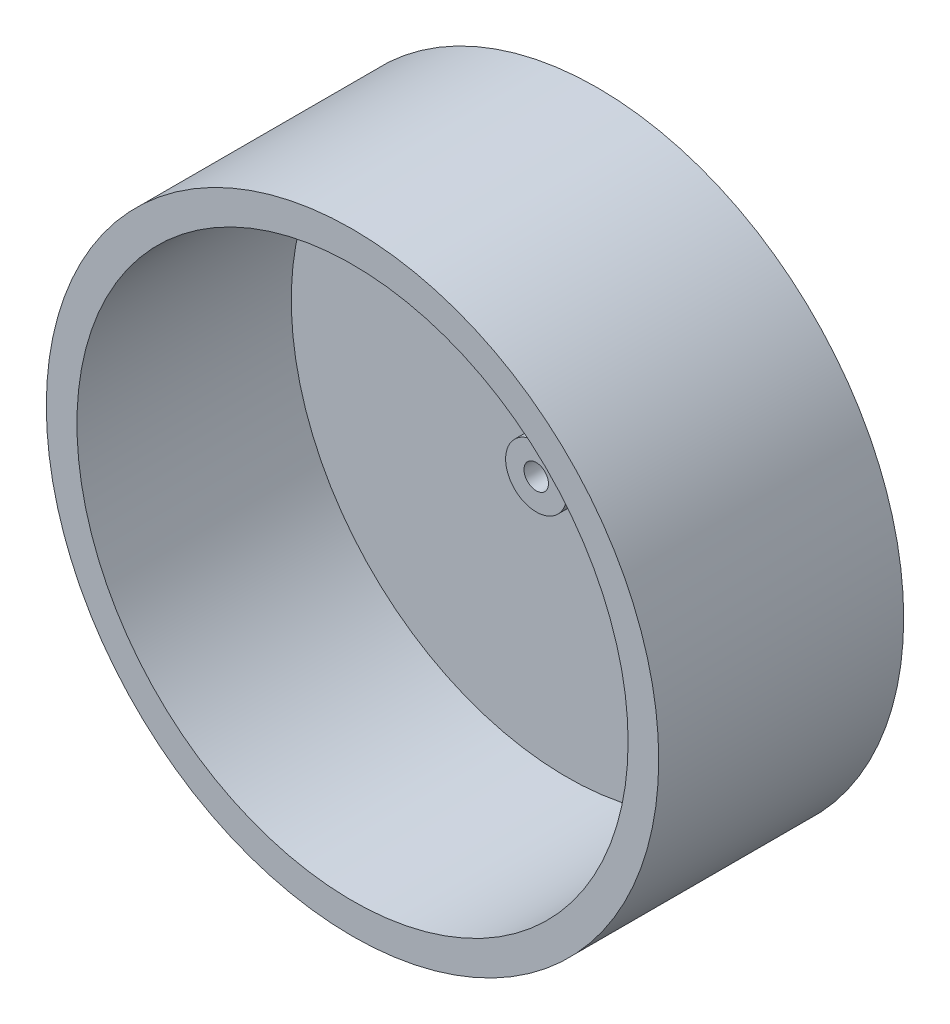
ISO-10303-21;
HEADER;
FILE_DESCRIPTION(('STEP AP214'),'2;1');
FILE_NAME('part.step','',(''),(''),'','','');
FILE_SCHEMA(('AUTOMOTIVE_DESIGN { 1 0 10303 214 1 1 1 1 }'));
ENDSEC;
DATA;
#1=APPLICATION_CONTEXT('core data for automotive mechanical design processes');
#2=APPLICATION_PROTOCOL_DEFINITION('international standard','automotive_design',2000,#1);
#3=PRODUCT_CONTEXT('',#1,'mechanical');
#4=PRODUCT('Part','Part','',(#3));
#5=PRODUCT_RELATED_PRODUCT_CATEGORY('part','',(#4));
#6=PRODUCT_DEFINITION_FORMATION('','',#4);
#7=PRODUCT_DEFINITION_CONTEXT('part definition',#1,'design');
#8=PRODUCT_DEFINITION('design','',#6,#7);
#9=PRODUCT_DEFINITION_SHAPE('','',#8);
#10=(LENGTH_UNIT() NAMED_UNIT(*) SI_UNIT(.MILLI.,.METRE.));
#11=(NAMED_UNIT(*) PLANE_ANGLE_UNIT() SI_UNIT($,.RADIAN.));
#12=(NAMED_UNIT(*) SI_UNIT($,.STERADIAN.) SOLID_ANGLE_UNIT());
#13=UNCERTAINTY_MEASURE_WITH_UNIT(LENGTH_MEASURE(1.E-05),#10,'distance_accuracy_value','');
#14=(GEOMETRIC_REPRESENTATION_CONTEXT(3) GLOBAL_UNCERTAINTY_ASSIGNED_CONTEXT((#13)) GLOBAL_UNIT_ASSIGNED_CONTEXT((#10,
#11,#12)) REPRESENTATION_CONTEXT('',''));
#15=CARTESIAN_POINT('',(0.,0.,0.));
#16=DIRECTION('',(0.,0.,1.));
#17=DIRECTION('',(1.,0.,0.));
#18=AXIS2_PLACEMENT_3D('',#15,#16,#17);
#19=CARTESIAN_POINT('',(0.,0.,5.));
#20=DIRECTION('',(0.,0.,1.));
#21=DIRECTION('',(1.,0.,0.));
#22=AXIS2_PLACEMENT_3D('',#19,#20,#21);
#23=PLANE('',#22);
#24=CARTESIAN_POINT('',(0.,0.,5.));
#25=DIRECTION('',(0.,0.,1.));
#26=DIRECTION('',(1.,0.,0.));
#27=AXIS2_PLACEMENT_3D('',#24,#25,#26);
#28=CIRCLE('',#27,45.);
#29=CARTESIAN_POINT('',(45.,0.,5.));
#30=VERTEX_POINT('',#29);
#31=EDGE_CURVE('E50',#30,#30,#28,.T.);
#32=ORIENTED_EDGE('',*,*,#31,.T.);
#33=EDGE_LOOP('',(#32));
#34=FACE_BOUND('',#33,.T.);
#35=CARTESIAN_POINT('',(0.,0.,5.));
#36=DIRECTION('',(0.,0.,1.));
#37=DIRECTION('',(1.,0.,0.));
#38=AXIS2_PLACEMENT_3D('',#35,#36,#37);
#39=CIRCLE('',#38,5.);
#40=CARTESIAN_POINT('',(5.,0.,5.));
#41=VERTEX_POINT('',#40);
#42=EDGE_CURVE('E57',#41,#41,#39,.T.);
#43=ORIENTED_EDGE('',*,*,#42,.F.);
#44=EDGE_LOOP('',(#43));
#45=FACE_BOUND('',#44,.T.);
#46=ADVANCED_FACE('F35',(#34,#45),#23,.T.);
#47=CARTESIAN_POINT('',(0.,0.,40.));
#48=DIRECTION('',(0.,0.,-1.));
#49=DIRECTION('',(-1.,0.,0.));
#50=AXIS2_PLACEMENT_3D('',#47,#48,#49);
#51=CYLINDRICAL_SURFACE('',#50,50.);
#52=CARTESIAN_POINT('',(0.,0.,40.));
#53=DIRECTION('',(0.,0.,1.));
#54=DIRECTION('',(1.,0.,0.));
#55=AXIS2_PLACEMENT_3D('',#52,#53,#54);
#56=CIRCLE('',#55,50.);
#57=CARTESIAN_POINT('',(50.,0.,40.));
#58=VERTEX_POINT('',#57);
#59=EDGE_CURVE('E10',#58,#58,#56,.T.);
#60=ORIENTED_EDGE('',*,*,#59,.F.);
#61=EDGE_LOOP('',(#60));
#62=FACE_BOUND('',#61,.T.);
#63=CARTESIAN_POINT('',(0.,0.,0.));
#64=DIRECTION('',(0.,0.,1.));
#65=DIRECTION('',(1.,0.,0.));
#66=AXIS2_PLACEMENT_3D('',#63,#64,#65);
#67=CIRCLE('',#66,50.);
#68=CARTESIAN_POINT('',(50.,0.,0.));
#69=VERTEX_POINT('',#68);
#70=EDGE_CURVE('E39',#69,#69,#67,.T.);
#71=ORIENTED_EDGE('',*,*,#70,.T.);
#72=EDGE_LOOP('',(#71));
#73=FACE_BOUND('',#72,.T.);
#74=ADVANCED_FACE('F37',(#62,#73),#51,.T.);
#75=CARTESIAN_POINT('',(0.,0.,40.));
#76=DIRECTION('',(0.,0.,1.));
#77=DIRECTION('',(1.,0.,0.));
#78=AXIS2_PLACEMENT_3D('',#75,#76,#77);
#79=PLANE('',#78);
#80=CARTESIAN_POINT('',(0.,0.,40.));
#81=DIRECTION('',(0.,0.,1.));
#82=DIRECTION('',(1.,0.,0.));
#83=AXIS2_PLACEMENT_3D('',#80,#81,#82);
#84=CIRCLE('',#83,45.);
#85=CARTESIAN_POINT('',(45.,0.,40.));
#86=VERTEX_POINT('',#85);
#87=EDGE_CURVE('E46',#86,#86,#84,.T.);
#88=ORIENTED_EDGE('',*,*,#87,.F.);
#89=EDGE_LOOP('',(#88));
#90=FACE_BOUND('',#89,.T.);
#91=ORIENTED_EDGE('',*,*,#59,.T.);
#92=EDGE_LOOP('',(#91));
#93=FACE_BOUND('',#92,.T.);
#94=ADVANCED_FACE('F88',(#90,#93),#79,.T.);
#95=CARTESIAN_POINT('',(0.,0.,0.));
#96=DIRECTION('',(0.,0.,1.));
#97=DIRECTION('',(1.,0.,0.));
#98=AXIS2_PLACEMENT_3D('',#95,#96,#97);
#99=PLANE('',#98);
#100=CARTESIAN_POINT('',(0.,0.,0.));
#101=DIRECTION('',(0.,0.,1.));
#102=DIRECTION('',(1.,0.,0.));
#103=AXIS2_PLACEMENT_3D('',#100,#101,#102);
#104=CIRCLE('',#103,2.);
#105=CARTESIAN_POINT('',(2.,0.,0.));
#106=VERTEX_POINT('',#105);
#107=EDGE_CURVE('E53',#106,#106,#104,.T.);
#108=ORIENTED_EDGE('',*,*,#107,.T.);
#109=EDGE_LOOP('',(#108));
#110=FACE_BOUND('',#109,.T.);
#111=ORIENTED_EDGE('',*,*,#70,.F.);
#112=EDGE_LOOP('',(#111));
#113=FACE_BOUND('',#112,.T.);
#114=ADVANCED_FACE('F94',(#110,#113),#99,.F.);
#115=CARTESIAN_POINT('',(0.,0.,40.));
#116=DIRECTION('',(0.,0.,-1.));
#117=DIRECTION('',(-1.,0.,0.));
#118=AXIS2_PLACEMENT_3D('',#115,#116,#117);
#119=CYLINDRICAL_SURFACE('',#118,45.);
#120=ORIENTED_EDGE('',*,*,#87,.T.);
#121=EDGE_LOOP('',(#120));
#122=FACE_BOUND('',#121,.T.);
#123=ORIENTED_EDGE('',*,*,#31,.F.);
#124=EDGE_LOOP('',(#123));
#125=FACE_BOUND('',#124,.T.);
#126=ADVANCED_FACE('F79',(#122,#125),#119,.F.);
#127=CARTESIAN_POINT('',(0.,0.,0.));
#128=DIRECTION('',(0.,0.,1.));
#129=DIRECTION('',(1.,0.,0.));
#130=AXIS2_PLACEMENT_3D('',#127,#128,#129);
#131=CYLINDRICAL_SURFACE('',#130,2.);
#132=ORIENTED_EDGE('',*,*,#107,.F.);
#133=EDGE_LOOP('',(#132));
#134=FACE_BOUND('',#133,.T.);
#135=CARTESIAN_POINT('',(0.,0.,10.));
#136=DIRECTION('',(0.,0.,1.));
#137=DIRECTION('',(1.,0.,0.));
#138=AXIS2_PLACEMENT_3D('',#135,#136,#137);
#139=CIRCLE('',#138,2.);
#140=CARTESIAN_POINT('',(2.,0.,10.));
#141=VERTEX_POINT('',#140);
#142=EDGE_CURVE('E60',#141,#141,#139,.T.);
#143=ORIENTED_EDGE('',*,*,#142,.T.);
#144=EDGE_LOOP('',(#143));
#145=FACE_BOUND('',#144,.T.);
#146=ADVANCED_FACE('F66',(#134,#145),#131,.F.);
#147=CARTESIAN_POINT('',(0.,0.,10.));
#148=DIRECTION('',(0.,0.,1.));
#149=DIRECTION('',(1.,0.,0.));
#150=AXIS2_PLACEMENT_3D('',#147,#148,#149);
#151=PLANE('',#150);
#152=CARTESIAN_POINT('',(0.,0.,10.));
#153=DIRECTION('',(0.,0.,1.));
#154=DIRECTION('',(1.,0.,0.));
#155=AXIS2_PLACEMENT_3D('',#152,#153,#154);
#156=CIRCLE('',#155,5.);
#157=CARTESIAN_POINT('',(5.,0.,10.));
#158=VERTEX_POINT('',#157);
#159=EDGE_CURVE('E56',#158,#158,#156,.T.);
#160=ORIENTED_EDGE('',*,*,#159,.T.);
#161=EDGE_LOOP('',(#160));
#162=FACE_BOUND('',#161,.T.);
#163=ORIENTED_EDGE('',*,*,#142,.F.);
#164=EDGE_LOOP('',(#163));
#165=FACE_BOUND('',#164,.T.);
#166=ADVANCED_FACE('F68',(#162,#165),#151,.T.);
#167=CARTESIAN_POINT('',(0.,0.,10.));
#168=DIRECTION('',(0.,0.,-1.));
#169=DIRECTION('',(-1.,0.,0.));
#170=AXIS2_PLACEMENT_3D('',#167,#168,#169);
#171=CYLINDRICAL_SURFACE('',#170,5.);
#172=ORIENTED_EDGE('',*,*,#159,.F.);
#173=EDGE_LOOP('',(#172));
#174=FACE_BOUND('',#173,.T.);
#175=ORIENTED_EDGE('',*,*,#42,.T.);
#176=EDGE_LOOP('',(#175));
#177=FACE_BOUND('',#176,.T.);
#178=ADVANCED_FACE('F70',(#174,#177),#171,.T.);
#179=CLOSED_SHELL('',(#46,#74,#94,#114,#126,#146,#166,#178));
#180=MANIFOLD_SOLID_BREP('B2',#179);
#181=ADVANCED_BREP_SHAPE_REPRESENTATION('',(#18,#180),#14);
#182=SHAPE_DEFINITION_REPRESENTATION(#9,#181);
ENDSEC;
END-ISO-10303-21;
